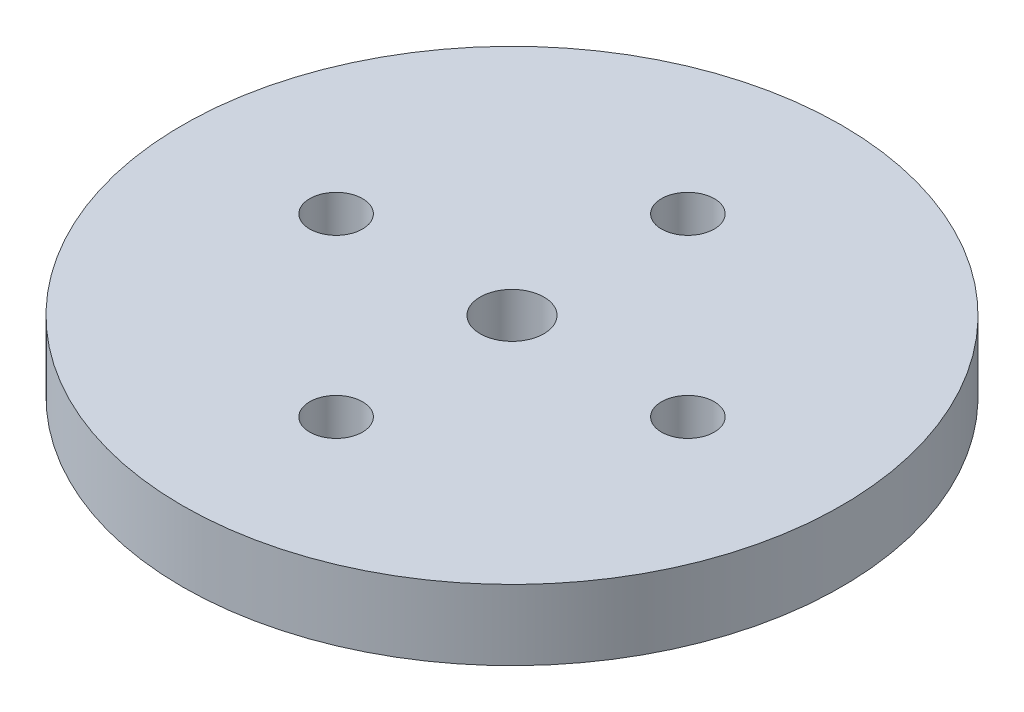
ISO-10303-21;
HEADER;
FILE_DESCRIPTION(('STEP AP214'),'2;1');
FILE_NAME('part.step','',(''),(''),'','','');
FILE_SCHEMA(('AUTOMOTIVE_DESIGN { 1 0 10303 214 1 1 1 1 }'));
ENDSEC;
DATA;
#1=APPLICATION_CONTEXT('core data for automotive mechanical design processes');
#2=APPLICATION_PROTOCOL_DEFINITION('international standard','automotive_design',2000,#1);
#3=PRODUCT_CONTEXT('',#1,'mechanical');
#4=PRODUCT('Part','Part','',(#3));
#5=PRODUCT_RELATED_PRODUCT_CATEGORY('part','',(#4));
#6=PRODUCT_DEFINITION_FORMATION('','',#4);
#7=PRODUCT_DEFINITION_CONTEXT('part definition',#1,'design');
#8=PRODUCT_DEFINITION('design','',#6,#7);
#9=PRODUCT_DEFINITION_SHAPE('','',#8);
#10=(LENGTH_UNIT() NAMED_UNIT(*) SI_UNIT(.MILLI.,.METRE.));
#11=(NAMED_UNIT(*) PLANE_ANGLE_UNIT() SI_UNIT($,.RADIAN.));
#12=(NAMED_UNIT(*) SI_UNIT($,.STERADIAN.) SOLID_ANGLE_UNIT());
#13=UNCERTAINTY_MEASURE_WITH_UNIT(LENGTH_MEASURE(1.E-05),#10,'distance_accuracy_value','');
#14=(GEOMETRIC_REPRESENTATION_CONTEXT(3) GLOBAL_UNCERTAINTY_ASSIGNED_CONTEXT((#13)) GLOBAL_UNIT_ASSIGNED_CONTEXT((#10,
#11,#12)) REPRESENTATION_CONTEXT('',''));
#15=CARTESIAN_POINT('',(0.,0.,0.));
#16=DIRECTION('',(0.,0.,1.));
#17=DIRECTION('',(1.,0.,0.));
#18=AXIS2_PLACEMENT_3D('',#15,#16,#17);
#19=CARTESIAN_POINT('',(0.,3.2,0.));
#20=DIRECTION('',(0.,1.,0.));
#21=DIRECTION('',(0.,0.,1.));
#22=AXIS2_PLACEMENT_3D('',#19,#20,#21);
#23=PLANE('',#22);
#24=CARTESIAN_POINT('',(0.,3.2,8.));
#25=DIRECTION('',(0.,1.,0.));
#26=DIRECTION('',(0.,0.,1.));
#27=AXIS2_PLACEMENT_3D('',#24,#25,#26);
#28=CIRCLE('',#27,1.20000000000005);
#29=CARTESIAN_POINT('',(0.,3.2,9.20000000000005));
#30=VERTEX_POINT('',#29);
#31=EDGE_CURVE('E61',#30,#30,#28,.T.);
#32=ORIENTED_EDGE('',*,*,#31,.F.);
#33=EDGE_LOOP('',(#32));
#34=FACE_BOUND('',#33,.T.);
#35=CARTESIAN_POINT('',(0.,3.2,-8.));
#36=DIRECTION('',(0.,1.,0.));
#37=DIRECTION('',(0.,0.,1.));
#38=AXIS2_PLACEMENT_3D('',#35,#36,#37);
#39=CIRCLE('',#38,1.2);
#40=CARTESIAN_POINT('',(0.,3.2,-6.8));
#41=VERTEX_POINT('',#40);
#42=EDGE_CURVE('E49',#41,#41,#39,.T.);
#43=ORIENTED_EDGE('',*,*,#42,.F.);
#44=EDGE_LOOP('',(#43));
#45=FACE_BOUND('',#44,.T.);
#46=CARTESIAN_POINT('',(0.,3.2,0.));
#47=DIRECTION('',(0.,1.,0.));
#48=DIRECTION('',(0.,0.,1.));
#49=AXIS2_PLACEMENT_3D('',#46,#47,#48);
#50=CIRCLE('',#49,14.99);
#51=CARTESIAN_POINT('',(0.,3.2,14.99));
#52=VERTEX_POINT('',#51);
#53=EDGE_CURVE('E10',#52,#52,#50,.T.);
#54=ORIENTED_EDGE('',*,*,#53,.T.);
#55=EDGE_LOOP('',(#54));
#56=FACE_BOUND('',#55,.T.);
#57=CARTESIAN_POINT('',(0.,3.2,0.));
#58=DIRECTION('',(0.,1.,0.));
#59=DIRECTION('',(0.,0.,1.));
#60=AXIS2_PLACEMENT_3D('',#57,#58,#59);
#61=CIRCLE('',#60,1.45);
#62=CARTESIAN_POINT('',(0.,3.2,1.45));
#63=VERTEX_POINT('',#62);
#64=EDGE_CURVE('E44',#63,#63,#61,.T.);
#65=ORIENTED_EDGE('',*,*,#64,.F.);
#66=EDGE_LOOP('',(#65));
#67=FACE_BOUND('',#66,.T.);
#68=CARTESIAN_POINT('',(8.00000000000023,3.2,-2.26393958003914E-13));
#69=DIRECTION('',(0.,1.,0.));
#70=DIRECTION('',(0.,0.,1.));
#71=AXIS2_PLACEMENT_3D('',#68,#69,#70);
#72=CIRCLE('',#71,1.20000000000018);
#73=CARTESIAN_POINT('',(8.00000000000023,3.2,1.19999999999995));
#74=VERTEX_POINT('',#73);
#75=EDGE_CURVE('E55',#74,#74,#72,.T.);
#76=ORIENTED_EDGE('',*,*,#75,.F.);
#77=EDGE_LOOP('',(#76));
#78=FACE_BOUND('',#77,.T.);
#79=CARTESIAN_POINT('',(-7.99999999999977,3.2,2.27373675443232E-13));
#80=DIRECTION('',(0.,1.,0.));
#81=DIRECTION('',(0.,0.,1.));
#82=AXIS2_PLACEMENT_3D('',#79,#80,#81);
#83=CIRCLE('',#82,1.20000000000036);
#84=CARTESIAN_POINT('',(-7.99999999999977,3.2,1.20000000000059));
#85=VERTEX_POINT('',#84);
#86=EDGE_CURVE('E67',#85,#85,#83,.T.);
#87=ORIENTED_EDGE('',*,*,#86,.F.);
#88=EDGE_LOOP('',(#87));
#89=FACE_BOUND('',#88,.T.);
#90=ADVANCED_FACE('F33',(#34,#45,#56,#67,#78,#89),#23,.T.);
#91=CARTESIAN_POINT('',(0.,0.,0.));
#92=DIRECTION('',(0.,1.,0.));
#93=DIRECTION('',(0.,0.,1.));
#94=AXIS2_PLACEMENT_3D('',#91,#92,#93);
#95=PLANE('',#94);
#96=CARTESIAN_POINT('',(0.,0.,0.));
#97=DIRECTION('',(0.,1.,0.));
#98=DIRECTION('',(0.,0.,1.));
#99=AXIS2_PLACEMENT_3D('',#96,#97,#98);
#100=CIRCLE('',#99,14.99);
#101=CARTESIAN_POINT('',(0.,0.,14.99));
#102=VERTEX_POINT('',#101);
#103=EDGE_CURVE('E37',#102,#102,#100,.T.);
#104=ORIENTED_EDGE('',*,*,#103,.F.);
#105=EDGE_LOOP('',(#104));
#106=FACE_BOUND('',#105,.T.);
#107=CARTESIAN_POINT('',(0.,0.,0.));
#108=DIRECTION('',(0.,1.,0.));
#109=DIRECTION('',(0.,0.,1.));
#110=AXIS2_PLACEMENT_3D('',#107,#108,#109);
#111=CIRCLE('',#110,1.45);
#112=CARTESIAN_POINT('',(0.,0.,1.45));
#113=VERTEX_POINT('',#112);
#114=EDGE_CURVE('E46',#113,#113,#111,.T.);
#115=ORIENTED_EDGE('',*,*,#114,.T.);
#116=EDGE_LOOP('',(#115));
#117=FACE_BOUND('',#116,.T.);
#118=CARTESIAN_POINT('',(0.,0.,-8.));
#119=DIRECTION('',(0.,1.,0.));
#120=DIRECTION('',(0.,0.,1.));
#121=AXIS2_PLACEMENT_3D('',#118,#119,#120);
#122=CIRCLE('',#121,1.2);
#123=CARTESIAN_POINT('',(0.,0.,-6.8));
#124=VERTEX_POINT('',#123);
#125=EDGE_CURVE('E52',#124,#124,#122,.T.);
#126=ORIENTED_EDGE('',*,*,#125,.T.);
#127=EDGE_LOOP('',(#126));
#128=FACE_BOUND('',#127,.T.);
#129=CARTESIAN_POINT('',(8.00000000000023,0.,-2.26393958003914E-13));
#130=DIRECTION('',(0.,1.,0.));
#131=DIRECTION('',(0.,0.,1.));
#132=AXIS2_PLACEMENT_3D('',#129,#130,#131);
#133=CIRCLE('',#132,1.20000000000018);
#134=CARTESIAN_POINT('',(8.00000000000023,0.,1.19999999999995));
#135=VERTEX_POINT('',#134);
#136=EDGE_CURVE('E58',#135,#135,#133,.T.);
#137=ORIENTED_EDGE('',*,*,#136,.T.);
#138=EDGE_LOOP('',(#137));
#139=FACE_BOUND('',#138,.T.);
#140=CARTESIAN_POINT('',(0.,0.,8.));
#141=DIRECTION('',(0.,1.,0.));
#142=DIRECTION('',(0.,0.,1.));
#143=AXIS2_PLACEMENT_3D('',#140,#141,#142);
#144=CIRCLE('',#143,1.20000000000005);
#145=CARTESIAN_POINT('',(0.,0.,9.20000000000005));
#146=VERTEX_POINT('',#145);
#147=EDGE_CURVE('E64',#146,#146,#144,.T.);
#148=ORIENTED_EDGE('',*,*,#147,.T.);
#149=EDGE_LOOP('',(#148));
#150=FACE_BOUND('',#149,.T.);
#151=CARTESIAN_POINT('',(-7.99999999999977,0.,2.27373675443232E-13));
#152=DIRECTION('',(0.,1.,0.));
#153=DIRECTION('',(0.,0.,1.));
#154=AXIS2_PLACEMENT_3D('',#151,#152,#153);
#155=CIRCLE('',#154,1.20000000000036);
#156=CARTESIAN_POINT('',(-7.99999999999977,0.,1.20000000000059));
#157=VERTEX_POINT('',#156);
#158=EDGE_CURVE('E70',#157,#157,#155,.T.);
#159=ORIENTED_EDGE('',*,*,#158,.T.);
#160=EDGE_LOOP('',(#159));
#161=FACE_BOUND('',#160,.T.);
#162=ADVANCED_FACE('F80',(#106,#117,#128,#139,#150,#161),#95,.F.);
#163=CARTESIAN_POINT('',(0.,3.2,0.));
#164=DIRECTION('',(0.,-1.,0.));
#165=DIRECTION('',(0.,0.,-1.));
#166=AXIS2_PLACEMENT_3D('',#163,#164,#165);
#167=CYLINDRICAL_SURFACE('',#166,14.99);
#168=ORIENTED_EDGE('',*,*,#53,.F.);
#169=EDGE_LOOP('',(#168));
#170=FACE_BOUND('',#169,.T.);
#171=ORIENTED_EDGE('',*,*,#103,.T.);
#172=EDGE_LOOP('',(#171));
#173=FACE_BOUND('',#172,.T.);
#174=ADVANCED_FACE('F35',(#170,#173),#167,.T.);
#175=CARTESIAN_POINT('',(0.,3.2,0.));
#176=DIRECTION('',(0.,-1.,0.));
#177=DIRECTION('',(0.,0.,-1.));
#178=AXIS2_PLACEMENT_3D('',#175,#176,#177);
#179=CYLINDRICAL_SURFACE('',#178,1.45);
#180=ORIENTED_EDGE('',*,*,#64,.T.);
#181=EDGE_LOOP('',(#180));
#182=FACE_BOUND('',#181,.T.);
#183=ORIENTED_EDGE('',*,*,#114,.F.);
#184=EDGE_LOOP('',(#183));
#185=FACE_BOUND('',#184,.T.);
#186=ADVANCED_FACE('F90',(#182,#185),#179,.F.);
#187=CARTESIAN_POINT('',(0.,3.2,-8.));
#188=DIRECTION('',(0.,-1.,0.));
#189=DIRECTION('',(0.,0.,-1.));
#190=AXIS2_PLACEMENT_3D('',#187,#188,#189);
#191=CYLINDRICAL_SURFACE('',#190,1.2);
#192=ORIENTED_EDGE('',*,*,#42,.T.);
#193=EDGE_LOOP('',(#192));
#194=FACE_BOUND('',#193,.T.);
#195=ORIENTED_EDGE('',*,*,#125,.F.);
#196=EDGE_LOOP('',(#195));
#197=FACE_BOUND('',#196,.T.);
#198=ADVANCED_FACE('F93',(#194,#197),#191,.F.);
#199=CARTESIAN_POINT('',(8.00000000000023,3.2,-2.26393958003914E-13));
#200=DIRECTION('',(0.,-1.,0.));
#201=DIRECTION('',(0.,0.,-1.));
#202=AXIS2_PLACEMENT_3D('',#199,#200,#201);
#203=CYLINDRICAL_SURFACE('',#202,1.20000000000018);
#204=ORIENTED_EDGE('',*,*,#75,.T.);
#205=EDGE_LOOP('',(#204));
#206=FACE_BOUND('',#205,.T.);
#207=ORIENTED_EDGE('',*,*,#136,.F.);
#208=EDGE_LOOP('',(#207));
#209=FACE_BOUND('',#208,.T.);
#210=ADVANCED_FACE('F97',(#206,#209),#203,.F.);
#211=CARTESIAN_POINT('',(0.,3.2,8.));
#212=DIRECTION('',(0.,-1.,0.));
#213=DIRECTION('',(0.,0.,-1.));
#214=AXIS2_PLACEMENT_3D('',#211,#212,#213);
#215=CYLINDRICAL_SURFACE('',#214,1.20000000000005);
#216=ORIENTED_EDGE('',*,*,#31,.T.);
#217=EDGE_LOOP('',(#216));
#218=FACE_BOUND('',#217,.T.);
#219=ORIENTED_EDGE('',*,*,#147,.F.);
#220=EDGE_LOOP('',(#219));
#221=FACE_BOUND('',#220,.T.);
#222=ADVANCED_FACE('F101',(#218,#221),#215,.F.);
#223=CARTESIAN_POINT('',(-7.99999999999977,3.2,2.27373675443232E-13));
#224=DIRECTION('',(0.,-1.,0.));
#225=DIRECTION('',(0.,0.,-1.));
#226=AXIS2_PLACEMENT_3D('',#223,#224,#225);
#227=CYLINDRICAL_SURFACE('',#226,1.20000000000036);
#228=ORIENTED_EDGE('',*,*,#86,.T.);
#229=EDGE_LOOP('',(#228));
#230=FACE_BOUND('',#229,.T.);
#231=ORIENTED_EDGE('',*,*,#158,.F.);
#232=EDGE_LOOP('',(#231));
#233=FACE_BOUND('',#232,.T.);
#234=ADVANCED_FACE('F76',(#230,#233),#227,.F.);
#235=CLOSED_SHELL('',(#90,#162,#174,#186,#198,#210,#222,#234));
#236=MANIFOLD_SOLID_BREP('B2',#235);
#237=ADVANCED_BREP_SHAPE_REPRESENTATION('',(#18,#236),#14);
#238=SHAPE_DEFINITION_REPRESENTATION(#9,#237);
ENDSEC;
END-ISO-10303-21;
